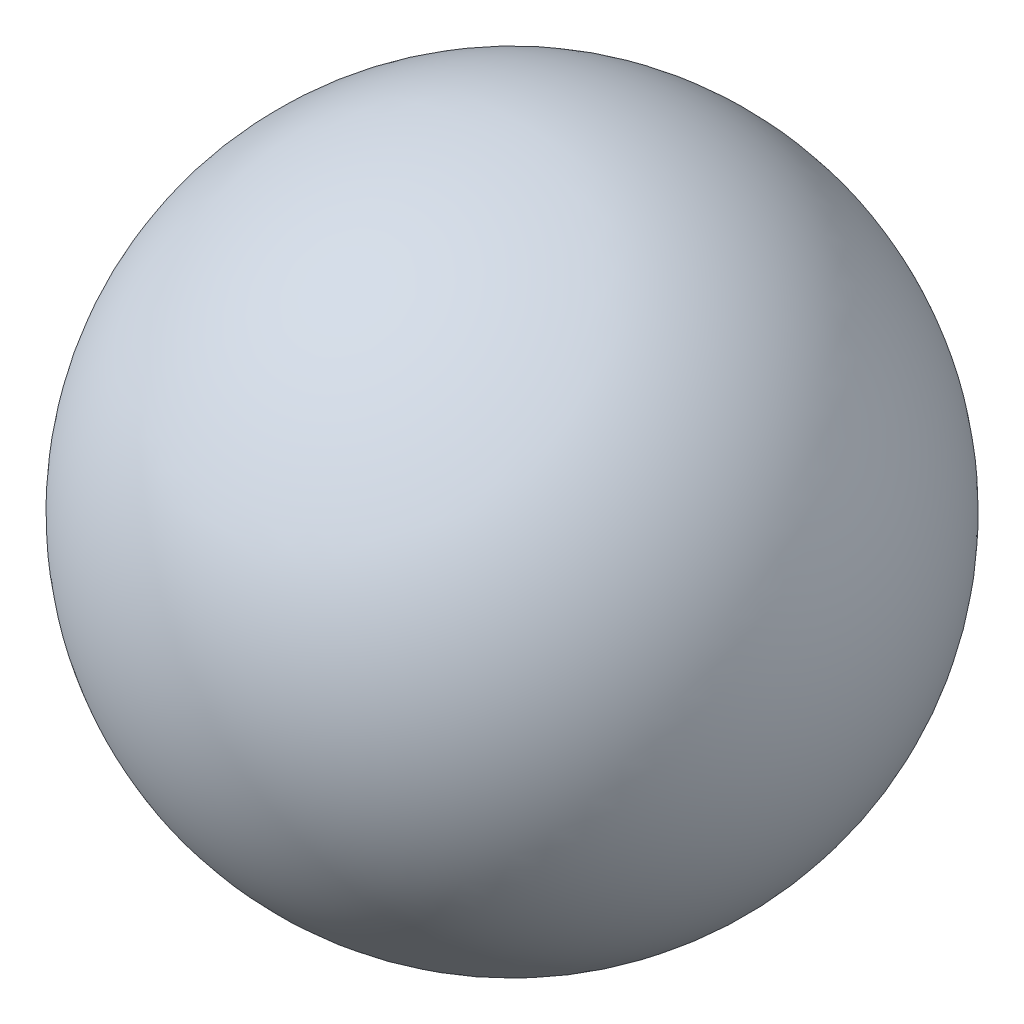
ISO-10303-21;
HEADER;
FILE_DESCRIPTION(('STEP AP214'),'2;1');
FILE_NAME('part.step','',(''),(''),'','','');
FILE_SCHEMA(('AUTOMOTIVE_DESIGN { 1 0 10303 214 1 1 1 1 }'));
ENDSEC;
DATA;
#1=APPLICATION_CONTEXT('core data for automotive mechanical design processes');
#2=APPLICATION_PROTOCOL_DEFINITION('international standard','automotive_design',2000,#1);
#3=PRODUCT_CONTEXT('',#1,'mechanical');
#4=PRODUCT('Part','Part','',(#3));
#5=PRODUCT_RELATED_PRODUCT_CATEGORY('part','',(#4));
#6=PRODUCT_DEFINITION_FORMATION('','',#4);
#7=PRODUCT_DEFINITION_CONTEXT('part definition',#1,'design');
#8=PRODUCT_DEFINITION('design','',#6,#7);
#9=PRODUCT_DEFINITION_SHAPE('','',#8);
#10=(LENGTH_UNIT() NAMED_UNIT(*) SI_UNIT(.MILLI.,.METRE.));
#11=(NAMED_UNIT(*) PLANE_ANGLE_UNIT() SI_UNIT($,.RADIAN.));
#12=(NAMED_UNIT(*) SI_UNIT($,.STERADIAN.) SOLID_ANGLE_UNIT());
#13=UNCERTAINTY_MEASURE_WITH_UNIT(LENGTH_MEASURE(1.E-05),#10,'distance_accuracy_value','');
#14=(GEOMETRIC_REPRESENTATION_CONTEXT(3) GLOBAL_UNCERTAINTY_ASSIGNED_CONTEXT((#13)) GLOBAL_UNIT_ASSIGNED_CONTEXT((#10,
#11,#12)) REPRESENTATION_CONTEXT('',''));
#15=CARTESIAN_POINT('',(0.,0.,0.));
#16=DIRECTION('',(0.,0.,1.));
#17=DIRECTION('',(1.,0.,0.));
#18=AXIS2_PLACEMENT_3D('',#15,#16,#17);
#19=CARTESIAN_POINT('',(0.,0.,0.));
#20=DIRECTION('',(0.,0.,1.));
#21=DIRECTION('',(-1.,0.,0.));
#22=AXIS2_PLACEMENT_3D('',#19,#20,#21);
#23=SPHERICAL_SURFACE('',#22,6.35);
#24=CARTESIAN_POINT('',(0.,0.,6.35));
#25=VERTEX_POINT('',#24);
#26=VERTEX_LOOP('',#25);
#27=FACE_BOUND('',#26,.T.);
#28=ADVANCED_FACE('F31',(#27),#23,.T.);
#29=CLOSED_SHELL('',(#28));
#30=MANIFOLD_SOLID_BREP('B2',#29);
#31=ADVANCED_BREP_SHAPE_REPRESENTATION('',(#18,#30),#14);
#32=SHAPE_DEFINITION_REPRESENTATION(#9,#31);
ENDSEC;
END-ISO-10303-21;
